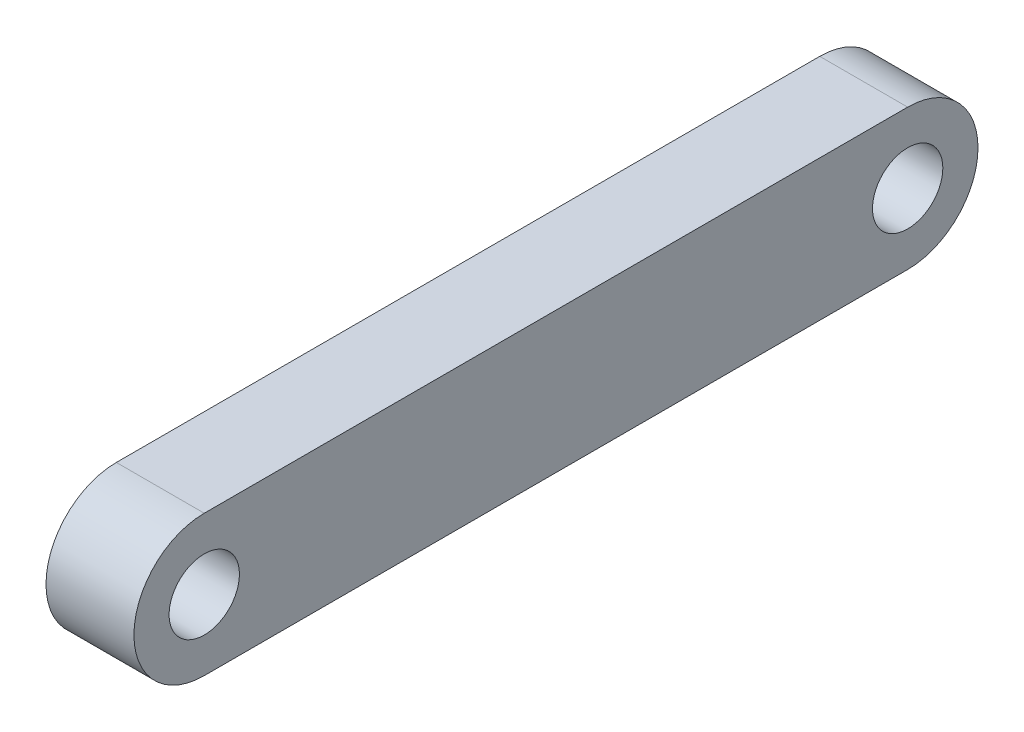
ISO-10303-21;
HEADER;
FILE_DESCRIPTION(('STEP AP214'),'2;1');
FILE_NAME('part.step','',(''),(''),'','','');
FILE_SCHEMA(('AUTOMOTIVE_DESIGN { 1 0 10303 214 1 1 1 1 }'));
ENDSEC;
DATA;
#1=APPLICATION_CONTEXT('core data for automotive mechanical design processes');
#2=APPLICATION_PROTOCOL_DEFINITION('international standard','automotive_design',2000,#1);
#3=PRODUCT_CONTEXT('',#1,'mechanical');
#4=PRODUCT('Part','Part','',(#3));
#5=PRODUCT_RELATED_PRODUCT_CATEGORY('part','',(#4));
#6=PRODUCT_DEFINITION_FORMATION('','',#4);
#7=PRODUCT_DEFINITION_CONTEXT('part definition',#1,'design');
#8=PRODUCT_DEFINITION('design','',#6,#7);
#9=PRODUCT_DEFINITION_SHAPE('','',#8);
#10=(LENGTH_UNIT() NAMED_UNIT(*) SI_UNIT(.MILLI.,.METRE.));
#11=(NAMED_UNIT(*) PLANE_ANGLE_UNIT() SI_UNIT($,.RADIAN.));
#12=(NAMED_UNIT(*) SI_UNIT($,.STERADIAN.) SOLID_ANGLE_UNIT());
#13=UNCERTAINTY_MEASURE_WITH_UNIT(LENGTH_MEASURE(1.E-05),#10,'distance_accuracy_value','');
#14=(GEOMETRIC_REPRESENTATION_CONTEXT(3) GLOBAL_UNCERTAINTY_ASSIGNED_CONTEXT((#13)) GLOBAL_UNIT_ASSIGNED_CONTEXT((#10,
#11,#12)) REPRESENTATION_CONTEXT('',''));
#15=CARTESIAN_POINT('',(0.,0.,0.));
#16=DIRECTION('',(0.,0.,1.));
#17=DIRECTION('',(1.,0.,0.));
#18=AXIS2_PLACEMENT_3D('',#15,#16,#17);
#19=CARTESIAN_POINT('',(10.,-7.99999999999999,0.));
#20=DIRECTION('',(0.,1.,0.));
#21=DIRECTION('',(0.,0.,1.));
#22=AXIS2_PLACEMENT_3D('',#19,#20,#21);
#23=PLANE('',#22);
#24=DIRECTION('',(0.,0.,-1.));
#25=VECTOR('',#24,1.);
#26=CARTESIAN_POINT('',(0.,-7.99999999999999,0.));
#27=LINE('',#26,#25);
#28=CARTESIAN_POINT('',(0.,-7.99999999999999,40.));
#29=VERTEX_POINT('',#28);
#30=CARTESIAN_POINT('',(0.,-7.99999999999999,-40.));
#31=VERTEX_POINT('',#30);
#32=EDGE_CURVE('E105',#29,#31,#27,.T.);
#33=ORIENTED_EDGE('',*,*,#32,.T.);
#34=DIRECTION('',(-1.,0.,0.));
#35=VECTOR('',#34,1.);
#36=CARTESIAN_POINT('',(10.,-7.99999999999999,-40.));
#37=LINE('',#36,#35);
#38=CARTESIAN_POINT('',(10.,-7.99999999999999,-40.));
#39=VERTEX_POINT('',#38);
#40=EDGE_CURVE('E11',#39,#31,#37,.T.);
#41=ORIENTED_EDGE('',*,*,#40,.F.);
#42=DIRECTION('',(0.,0.,-1.));
#43=VECTOR('',#42,1.);
#44=CARTESIAN_POINT('',(10.,-7.99999999999999,0.));
#45=LINE('',#44,#43);
#46=CARTESIAN_POINT('',(10.,-7.99999999999999,40.));
#47=VERTEX_POINT('',#46);
#48=EDGE_CURVE('E85',#47,#39,#45,.T.);
#49=ORIENTED_EDGE('',*,*,#48,.F.);
#50=DIRECTION('',(-1.,0.,0.));
#51=VECTOR('',#50,1.);
#52=CARTESIAN_POINT('',(10.,-7.99999999999999,40.));
#53=LINE('',#52,#51);
#54=EDGE_CURVE('E52',#47,#29,#53,.T.);
#55=ORIENTED_EDGE('',*,*,#54,.T.);
#56=EDGE_LOOP('',(#33,#41,#49,#55));
#57=FACE_BOUND('',#56,.T.);
#58=ADVANCED_FACE('F35',(#57),#23,.F.);
#59=CARTESIAN_POINT('',(10.,0.,-40.));
#60=DIRECTION('',(-1.,0.,0.));
#61=DIRECTION('',(0.,0.,1.));
#62=AXIS2_PLACEMENT_3D('',#59,#60,#61);
#63=CYLINDRICAL_SURFACE('',#62,7.99999999999999);
#64=CARTESIAN_POINT('',(0.,0.,-40.));
#65=DIRECTION('',(1.,0.,0.));
#66=DIRECTION('',(0.,0.,-1.));
#67=AXIS2_PLACEMENT_3D('',#64,#65,#66);
#68=CIRCLE('',#67,7.99999999999999);
#69=CARTESIAN_POINT('',(0.,7.99999999999998,-40.));
#70=VERTEX_POINT('',#69);
#71=EDGE_CURVE('E90',#31,#70,#68,.T.);
#72=ORIENTED_EDGE('',*,*,#71,.T.);
#73=DIRECTION('',(-1.,0.,0.));
#74=VECTOR('',#73,1.);
#75=CARTESIAN_POINT('',(10.,7.99999999999998,-40.));
#76=LINE('',#75,#74);
#77=CARTESIAN_POINT('',(10.,7.99999999999998,-40.));
#78=VERTEX_POINT('',#77);
#79=EDGE_CURVE('E44',#78,#70,#76,.T.);
#80=ORIENTED_EDGE('',*,*,#79,.F.);
#81=CARTESIAN_POINT('',(10.,0.,-40.));
#82=DIRECTION('',(1.,0.,0.));
#83=DIRECTION('',(0.,0.,-1.));
#84=AXIS2_PLACEMENT_3D('',#81,#82,#83);
#85=CIRCLE('',#84,7.99999999999999);
#86=EDGE_CURVE('E77',#39,#78,#85,.T.);
#87=ORIENTED_EDGE('',*,*,#86,.F.);
#88=ORIENTED_EDGE('',*,*,#40,.T.);
#89=EDGE_LOOP('',(#72,#80,#87,#88));
#90=FACE_BOUND('',#89,.T.);
#91=ADVANCED_FACE('F89',(#90),#63,.T.);
#92=CARTESIAN_POINT('',(10.,7.99999999999998,0.));
#93=DIRECTION('',(0.,1.,0.));
#94=DIRECTION('',(0.,0.,1.));
#95=AXIS2_PLACEMENT_3D('',#92,#93,#94);
#96=PLANE('',#95);
#97=DIRECTION('',(0.,0.,-1.));
#98=VECTOR('',#97,1.);
#99=CARTESIAN_POINT('',(0.,7.99999999999998,0.));
#100=LINE('',#99,#98);
#101=CARTESIAN_POINT('',(0.,7.99999999999998,40.));
#102=VERTEX_POINT('',#101);
#103=EDGE_CURVE('E108',#102,#70,#100,.T.);
#104=ORIENTED_EDGE('',*,*,#103,.F.);
#105=DIRECTION('',(-1.,0.,0.));
#106=VECTOR('',#105,1.);
#107=CARTESIAN_POINT('',(10.,7.99999999999998,40.));
#108=LINE('',#107,#106);
#109=CARTESIAN_POINT('',(10.,7.99999999999998,40.));
#110=VERTEX_POINT('',#109);
#111=EDGE_CURVE('E66',#110,#102,#108,.T.);
#112=ORIENTED_EDGE('',*,*,#111,.F.);
#113=DIRECTION('',(0.,0.,-1.));
#114=VECTOR('',#113,1.);
#115=CARTESIAN_POINT('',(10.,7.99999999999998,0.));
#116=LINE('',#115,#114);
#117=EDGE_CURVE('E84',#110,#78,#116,.T.);
#118=ORIENTED_EDGE('',*,*,#117,.T.);
#119=ORIENTED_EDGE('',*,*,#79,.T.);
#120=EDGE_LOOP('',(#104,#112,#118,#119));
#121=FACE_BOUND('',#120,.T.);
#122=ADVANCED_FACE('F93',(#121),#96,.T.);
#123=CARTESIAN_POINT('',(10.,0.,40.));
#124=DIRECTION('',(-1.,0.,0.));
#125=DIRECTION('',(0.,0.,1.));
#126=AXIS2_PLACEMENT_3D('',#123,#124,#125);
#127=CYLINDRICAL_SURFACE('',#126,4.00000000000001);
#128=CARTESIAN_POINT('',(10.,0.,40.));
#129=DIRECTION('',(1.,0.,0.));
#130=DIRECTION('',(0.,0.,-1.));
#131=AXIS2_PLACEMENT_3D('',#128,#129,#130);
#132=CIRCLE('',#131,4.00000000000001);
#133=CARTESIAN_POINT('',(10.,0.,36.));
#134=VERTEX_POINT('',#133);
#135=EDGE_CURVE('E117',#134,#134,#132,.T.);
#136=ORIENTED_EDGE('',*,*,#135,.T.);
#137=EDGE_LOOP('',(#136));
#138=FACE_BOUND('',#137,.T.);
#139=CARTESIAN_POINT('',(0.,0.,40.));
#140=DIRECTION('',(1.,0.,0.));
#141=DIRECTION('',(0.,0.,-1.));
#142=AXIS2_PLACEMENT_3D('',#139,#140,#141);
#143=CIRCLE('',#142,4.00000000000001);
#144=CARTESIAN_POINT('',(0.,0.,36.));
#145=VERTEX_POINT('',#144);
#146=EDGE_CURVE('E102',#145,#145,#143,.T.);
#147=ORIENTED_EDGE('',*,*,#146,.F.);
#148=EDGE_LOOP('',(#147));
#149=FACE_BOUND('',#148,.T.);
#150=ADVANCED_FACE('F125',(#138,#149),#127,.F.);
#151=CARTESIAN_POINT('',(10.,0.,-40.));
#152=DIRECTION('',(-1.,0.,0.));
#153=DIRECTION('',(0.,0.,1.));
#154=AXIS2_PLACEMENT_3D('',#151,#152,#153);
#155=CYLINDRICAL_SURFACE('',#154,4.00000000000001);
#156=CARTESIAN_POINT('',(10.,0.,-40.));
#157=DIRECTION('',(1.,0.,0.));
#158=DIRECTION('',(0.,0.,-1.));
#159=AXIS2_PLACEMENT_3D('',#156,#157,#158);
#160=CIRCLE('',#159,4.00000000000001);
#161=CARTESIAN_POINT('',(10.,0.,-44.));
#162=VERTEX_POINT('',#161);
#163=EDGE_CURVE('E113',#162,#162,#160,.F.);
#164=ORIENTED_EDGE('',*,*,#163,.F.);
#165=EDGE_LOOP('',(#164));
#166=FACE_BOUND('',#165,.T.);
#167=CARTESIAN_POINT('',(0.,0.,-40.));
#168=DIRECTION('',(1.,0.,0.));
#169=DIRECTION('',(0.,0.,-1.));
#170=AXIS2_PLACEMENT_3D('',#167,#168,#169);
#171=CIRCLE('',#170,4.00000000000001);
#172=CARTESIAN_POINT('',(0.,0.,-44.));
#173=VERTEX_POINT('',#172);
#174=EDGE_CURVE('E99',#173,#173,#171,.F.);
#175=ORIENTED_EDGE('',*,*,#174,.T.);
#176=EDGE_LOOP('',(#175));
#177=FACE_BOUND('',#176,.T.);
#178=ADVANCED_FACE('F37',(#166,#177),#155,.F.);
#179=CARTESIAN_POINT('',(10.,0.,40.));
#180=DIRECTION('',(-1.,0.,0.));
#181=DIRECTION('',(0.,0.,1.));
#182=AXIS2_PLACEMENT_3D('',#179,#180,#181);
#183=CYLINDRICAL_SURFACE('',#182,7.99999999999999);
#184=CARTESIAN_POINT('',(0.,0.,40.));
#185=DIRECTION('',(1.,0.,0.));
#186=DIRECTION('',(0.,0.,-1.));
#187=AXIS2_PLACEMENT_3D('',#184,#185,#186);
#188=CIRCLE('',#187,7.99999999999999);
#189=EDGE_CURVE('E110',#29,#102,#188,.F.);
#190=ORIENTED_EDGE('',*,*,#189,.F.);
#191=ORIENTED_EDGE('',*,*,#54,.F.);
#192=CARTESIAN_POINT('',(10.,0.,40.));
#193=DIRECTION('',(1.,0.,0.));
#194=DIRECTION('',(0.,0.,-1.));
#195=AXIS2_PLACEMENT_3D('',#192,#193,#194);
#196=CIRCLE('',#195,7.99999999999999);
#197=EDGE_CURVE('E94',#47,#110,#196,.F.);
#198=ORIENTED_EDGE('',*,*,#197,.T.);
#199=ORIENTED_EDGE('',*,*,#111,.T.);
#200=EDGE_LOOP('',(#190,#191,#198,#199));
#201=FACE_BOUND('',#200,.T.);
#202=ADVANCED_FACE('F130',(#201),#183,.T.);
#203=CARTESIAN_POINT('',(10.,0.,0.));
#204=DIRECTION('',(1.,0.,0.));
#205=DIRECTION('',(0.,0.,-1.));
#206=AXIS2_PLACEMENT_3D('',#203,#204,#205);
#207=PLANE('',#206);
#208=ORIENTED_EDGE('',*,*,#163,.T.);
#209=EDGE_LOOP('',(#208));
#210=FACE_BOUND('',#209,.T.);
#211=ORIENTED_EDGE('',*,*,#135,.F.);
#212=EDGE_LOOP('',(#211));
#213=FACE_BOUND('',#212,.T.);
#214=ORIENTED_EDGE('',*,*,#48,.T.);
#215=ORIENTED_EDGE('',*,*,#86,.T.);
#216=ORIENTED_EDGE('',*,*,#117,.F.);
#217=ORIENTED_EDGE('',*,*,#197,.F.);
#218=EDGE_LOOP('',(#214,#215,#216,#217));
#219=FACE_BOUND('',#218,.T.);
#220=ADVANCED_FACE('F81',(#210,#213,#219),#207,.T.);
#221=CARTESIAN_POINT('',(0.,0.,0.));
#222=DIRECTION('',(1.,0.,0.));
#223=DIRECTION('',(0.,0.,-1.));
#224=AXIS2_PLACEMENT_3D('',#221,#222,#223);
#225=PLANE('',#224);
#226=ORIENTED_EDGE('',*,*,#174,.F.);
#227=EDGE_LOOP('',(#226));
#228=FACE_BOUND('',#227,.T.);
#229=ORIENTED_EDGE('',*,*,#146,.T.);
#230=EDGE_LOOP('',(#229));
#231=FACE_BOUND('',#230,.T.);
#232=ORIENTED_EDGE('',*,*,#32,.F.);
#233=ORIENTED_EDGE('',*,*,#189,.T.);
#234=ORIENTED_EDGE('',*,*,#103,.T.);
#235=ORIENTED_EDGE('',*,*,#71,.F.);
#236=EDGE_LOOP('',(#232,#233,#234,#235));
#237=FACE_BOUND('',#236,.T.);
#238=ADVANCED_FACE('F129',(#228,#231,#237),#225,.F.);
#239=CLOSED_SHELL('',(#58,#91,#122,#150,#178,#202,#220,#238));
#240=MANIFOLD_SOLID_BREP('B2',#239);
#241=ADVANCED_BREP_SHAPE_REPRESENTATION('',(#18,#240),#14);
#242=SHAPE_DEFINITION_REPRESENTATION(#9,#241);
ENDSEC;
END-ISO-10303-21;
